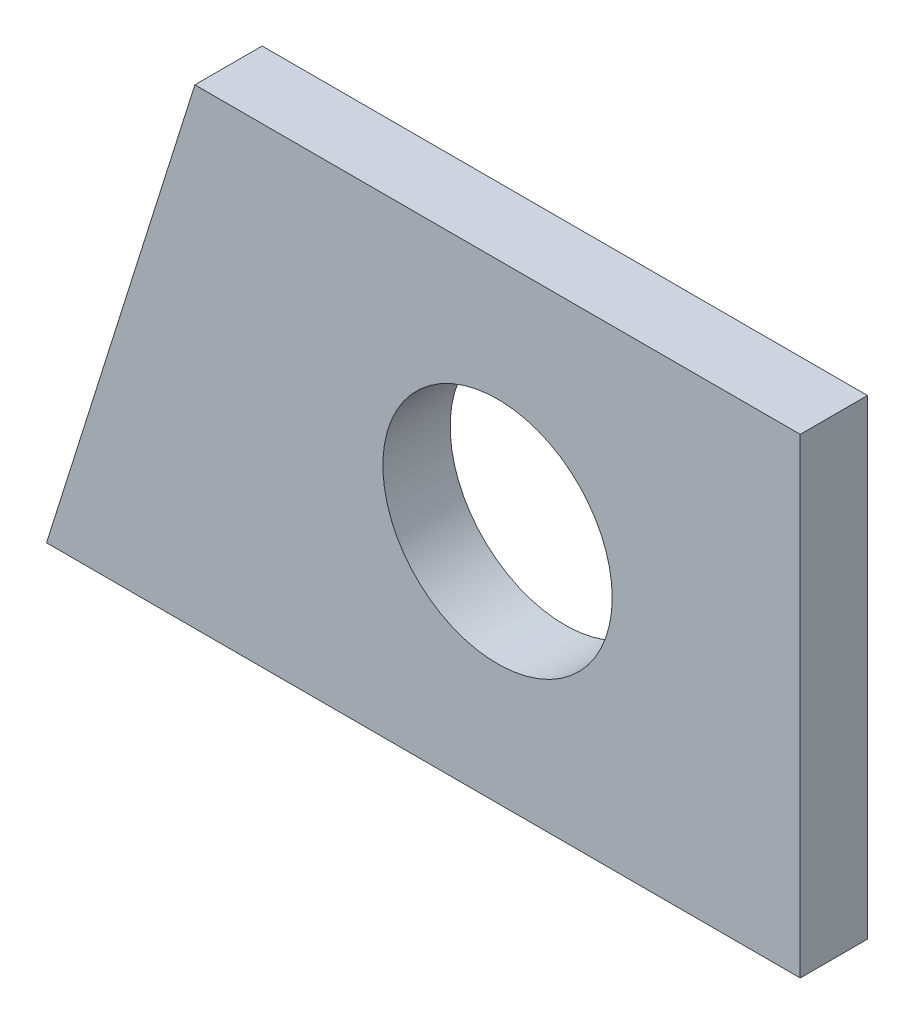
ISO-10303-21;
HEADER;
FILE_DESCRIPTION(('STEP AP214'),'2;1');
FILE_NAME('part.step','',(''),(''),'','','');
FILE_SCHEMA(('AUTOMOTIVE_DESIGN { 1 0 10303 214 1 1 1 1 }'));
ENDSEC;
DATA;
#1=APPLICATION_CONTEXT('core data for automotive mechanical design processes');
#2=APPLICATION_PROTOCOL_DEFINITION('international standard','automotive_design',2000,#1);
#3=PRODUCT_CONTEXT('',#1,'mechanical');
#4=PRODUCT('Part','Part','',(#3));
#5=PRODUCT_RELATED_PRODUCT_CATEGORY('part','',(#4));
#6=PRODUCT_DEFINITION_FORMATION('','',#4);
#7=PRODUCT_DEFINITION_CONTEXT('part definition',#1,'design');
#8=PRODUCT_DEFINITION('design','',#6,#7);
#9=PRODUCT_DEFINITION_SHAPE('','',#8);
#10=(LENGTH_UNIT() NAMED_UNIT(*) SI_UNIT(.MILLI.,.METRE.));
#11=(NAMED_UNIT(*) PLANE_ANGLE_UNIT() SI_UNIT($,.RADIAN.));
#12=(NAMED_UNIT(*) SI_UNIT($,.STERADIAN.) SOLID_ANGLE_UNIT());
#13=UNCERTAINTY_MEASURE_WITH_UNIT(LENGTH_MEASURE(1.E-05),#10,'distance_accuracy_value','');
#14=(GEOMETRIC_REPRESENTATION_CONTEXT(3) GLOBAL_UNCERTAINTY_ASSIGNED_CONTEXT((#13)) GLOBAL_UNIT_ASSIGNED_CONTEXT((#10,
#11,#12)) REPRESENTATION_CONTEXT('',''));
#15=CARTESIAN_POINT('',(0.,0.,0.));
#16=DIRECTION('',(0.,0.,1.));
#17=DIRECTION('',(1.,0.,0.));
#18=AXIS2_PLACEMENT_3D('',#15,#16,#17);
#19=CARTESIAN_POINT('',(0.,0.,1.));
#20=DIRECTION('',(0.,0.,-1.));
#21=DIRECTION('',(-1.,0.,0.));
#22=AXIS2_PLACEMENT_3D('',#19,#20,#21);
#23=PLANE('',#22);
#24=DIRECTION('',(-1.,0.,0.));
#25=VECTOR('',#24,1.);
#26=CARTESIAN_POINT('',(5.60287420464197,3.5,1.));
#27=LINE('',#26,#25);
#28=CARTESIAN_POINT('',(5.60287420464197,3.5,1.));
#29=VERTEX_POINT('',#28);
#30=CARTESIAN_POINT('',(-3.39712579535803,3.5,1.));
#31=VERTEX_POINT('',#30);
#32=EDGE_CURVE('E86',#29,#31,#27,.T.);
#33=ORIENTED_EDGE('',*,*,#32,.T.);
#34=DIRECTION('',(-0.300539339915884,-0.953769419284831,0.));
#35=VECTOR('',#34,1.);
#36=CARTESIAN_POINT('',(-3.39712579535803,3.5,1.));
#37=LINE('',#36,#35);
#38=CARTESIAN_POINT('',(-5.60287420464198,-3.5,1.));
#39=VERTEX_POINT('',#38);
#40=EDGE_CURVE('E81',#31,#39,#37,.T.);
#41=ORIENTED_EDGE('',*,*,#40,.T.);
#42=DIRECTION('',(1.,0.,0.));
#43=VECTOR('',#42,1.);
#44=CARTESIAN_POINT('',(-5.60287420464198,-3.5,1.));
#45=LINE('',#44,#43);
#46=CARTESIAN_POINT('',(5.60287420464197,-3.5,1.));
#47=VERTEX_POINT('',#46);
#48=EDGE_CURVE('E84',#39,#47,#45,.T.);
#49=ORIENTED_EDGE('',*,*,#48,.T.);
#50=DIRECTION('',(0.,1.,0.));
#51=VECTOR('',#50,1.);
#52=CARTESIAN_POINT('',(5.60287420464197,-3.5,1.));
#53=LINE('',#52,#51);
#54=EDGE_CURVE('E51',#47,#29,#53,.T.);
#55=ORIENTED_EDGE('',*,*,#54,.T.);
#56=EDGE_LOOP('',(#33,#41,#49,#55));
#57=FACE_BOUND('',#56,.T.);
#58=CARTESIAN_POINT('',(1.10287420464197,0.,1.));
#59=DIRECTION('',(0.,0.,1.));
#60=DIRECTION('',(1.,0.,0.));
#61=AXIS2_PLACEMENT_3D('',#58,#59,#60);
#62=CIRCLE('',#61,1.705);
#63=CARTESIAN_POINT('',(2.80787420464197,0.,1.));
#64=VERTEX_POINT('',#63);
#65=EDGE_CURVE('E101',#64,#64,#62,.T.);
#66=ORIENTED_EDGE('',*,*,#65,.F.);
#67=EDGE_LOOP('',(#66));
#68=FACE_BOUND('',#67,.T.);
#69=ADVANCED_FACE('F34',(#57,#68),#23,.F.);
#70=CARTESIAN_POINT('',(0.,0.,0.));
#71=DIRECTION('',(0.,0.,-1.));
#72=DIRECTION('',(-1.,0.,0.));
#73=AXIS2_PLACEMENT_3D('',#70,#71,#72);
#74=PLANE('',#73);
#75=DIRECTION('',(-1.,0.,0.));
#76=VECTOR('',#75,1.);
#77=CARTESIAN_POINT('',(5.60287420464197,3.5,0.));
#78=LINE('',#77,#76);
#79=CARTESIAN_POINT('',(5.60287420464197,3.5,0.));
#80=VERTEX_POINT('',#79);
#81=CARTESIAN_POINT('',(-3.39712579535803,3.5,0.));
#82=VERTEX_POINT('',#81);
#83=EDGE_CURVE('E98',#80,#82,#78,.T.);
#84=ORIENTED_EDGE('',*,*,#83,.F.);
#85=DIRECTION('',(0.,1.,0.));
#86=VECTOR('',#85,1.);
#87=CARTESIAN_POINT('',(5.60287420464197,-3.5,0.));
#88=LINE('',#87,#86);
#89=CARTESIAN_POINT('',(5.60287420464197,-3.5,0.));
#90=VERTEX_POINT('',#89);
#91=EDGE_CURVE('E74',#90,#80,#88,.T.);
#92=ORIENTED_EDGE('',*,*,#91,.F.);
#93=DIRECTION('',(1.,0.,0.));
#94=VECTOR('',#93,1.);
#95=CARTESIAN_POINT('',(-5.60287420464198,-3.5,0.));
#96=LINE('',#95,#94);
#97=CARTESIAN_POINT('',(-5.60287420464198,-3.5,0.));
#98=VERTEX_POINT('',#97);
#99=EDGE_CURVE('E68',#98,#90,#96,.T.);
#100=ORIENTED_EDGE('',*,*,#99,.F.);
#101=DIRECTION('',(-0.300539339915884,-0.953769419284831,0.));
#102=VECTOR('',#101,1.);
#103=CARTESIAN_POINT('',(-3.39712579535803,3.5,0.));
#104=LINE('',#103,#102);
#105=EDGE_CURVE('E90',#82,#98,#104,.T.);
#106=ORIENTED_EDGE('',*,*,#105,.F.);
#107=EDGE_LOOP('',(#84,#92,#100,#106));
#108=FACE_BOUND('',#107,.T.);
#109=CARTESIAN_POINT('',(1.10287420464197,0.,0.));
#110=DIRECTION('',(0.,0.,1.));
#111=DIRECTION('',(1.,0.,0.));
#112=AXIS2_PLACEMENT_3D('',#109,#110,#111);
#113=CIRCLE('',#112,1.705);
#114=CARTESIAN_POINT('',(2.80787420464197,0.,0.));
#115=VERTEX_POINT('',#114);
#116=EDGE_CURVE('E113',#115,#115,#113,.T.);
#117=ORIENTED_EDGE('',*,*,#116,.T.);
#118=EDGE_LOOP('',(#117));
#119=FACE_BOUND('',#118,.T.);
#120=ADVANCED_FACE('F109',(#108,#119),#74,.T.);
#121=CARTESIAN_POINT('',(5.60287420464197,3.5,1.));
#122=DIRECTION('',(0.,-1.,0.));
#123=DIRECTION('',(0.,0.,-1.));
#124=AXIS2_PLACEMENT_3D('',#121,#122,#123);
#125=PLANE('',#124);
#126=ORIENTED_EDGE('',*,*,#83,.T.);
#127=DIRECTION('',(0.,0.,-1.));
#128=VECTOR('',#127,1.);
#129=CARTESIAN_POINT('',(-3.39712579535803,3.5,1.));
#130=LINE('',#129,#128);
#131=EDGE_CURVE('E11',#31,#82,#130,.T.);
#132=ORIENTED_EDGE('',*,*,#131,.F.);
#133=ORIENTED_EDGE('',*,*,#32,.F.);
#134=DIRECTION('',(0.,0.,-1.));
#135=VECTOR('',#134,1.);
#136=CARTESIAN_POINT('',(5.60287420464197,3.5,1.));
#137=LINE('',#136,#135);
#138=EDGE_CURVE('E94',#29,#80,#137,.T.);
#139=ORIENTED_EDGE('',*,*,#138,.T.);
#140=EDGE_LOOP('',(#126,#132,#133,#139));
#141=FACE_BOUND('',#140,.T.);
#142=ADVANCED_FACE('F36',(#141),#125,.F.);
#143=CARTESIAN_POINT('',(-3.39712579535803,3.5,1.));
#144=DIRECTION('',(0.953769419284831,-0.300539339915884,0.));
#145=DIRECTION('',(0.300539339915884,0.953769419284831,0.));
#146=AXIS2_PLACEMENT_3D('',#143,#144,#145);
#147=PLANE('',#146);
#148=ORIENTED_EDGE('',*,*,#105,.T.);
#149=DIRECTION('',(0.,0.,-1.));
#150=VECTOR('',#149,1.);
#151=CARTESIAN_POINT('',(-5.60287420464198,-3.5,1.));
#152=LINE('',#151,#150);
#153=EDGE_CURVE('E43',#39,#98,#152,.T.);
#154=ORIENTED_EDGE('',*,*,#153,.F.);
#155=ORIENTED_EDGE('',*,*,#40,.F.);
#156=ORIENTED_EDGE('',*,*,#131,.T.);
#157=EDGE_LOOP('',(#148,#154,#155,#156));
#158=FACE_BOUND('',#157,.T.);
#159=ADVANCED_FACE('F89',(#158),#147,.F.);
#160=CARTESIAN_POINT('',(-5.60287420464198,-3.5,1.));
#161=DIRECTION('',(0.,1.,0.));
#162=DIRECTION('',(-1.,0.,0.));
#163=AXIS2_PLACEMENT_3D('',#160,#161,#162);
#164=PLANE('',#163);
#165=ORIENTED_EDGE('',*,*,#99,.T.);
#166=DIRECTION('',(0.,0.,-1.));
#167=VECTOR('',#166,1.);
#168=CARTESIAN_POINT('',(5.60287420464197,-3.5,1.));
#169=LINE('',#168,#167);
#170=EDGE_CURVE('E91',#47,#90,#169,.T.);
#171=ORIENTED_EDGE('',*,*,#170,.F.);
#172=ORIENTED_EDGE('',*,*,#48,.F.);
#173=ORIENTED_EDGE('',*,*,#153,.T.);
#174=EDGE_LOOP('',(#165,#171,#172,#173));
#175=FACE_BOUND('',#174,.T.);
#176=ADVANCED_FACE('F92',(#175),#164,.F.);
#177=CARTESIAN_POINT('',(5.60287420464197,-3.5,1.));
#178=DIRECTION('',(-1.,0.,0.));
#179=DIRECTION('',(0.,0.,1.));
#180=AXIS2_PLACEMENT_3D('',#177,#178,#179);
#181=PLANE('',#180);
#182=ORIENTED_EDGE('',*,*,#91,.T.);
#183=ORIENTED_EDGE('',*,*,#138,.F.);
#184=ORIENTED_EDGE('',*,*,#54,.F.);
#185=ORIENTED_EDGE('',*,*,#170,.T.);
#186=EDGE_LOOP('',(#182,#183,#184,#185));
#187=FACE_BOUND('',#186,.T.);
#188=ADVANCED_FACE('F106',(#187),#181,.F.);
#189=CARTESIAN_POINT('',(1.10287420464197,0.,1.));
#190=DIRECTION('',(0.,0.,-1.));
#191=DIRECTION('',(-1.,0.,0.));
#192=AXIS2_PLACEMENT_3D('',#189,#190,#191);
#193=CYLINDRICAL_SURFACE('',#192,1.705);
#194=ORIENTED_EDGE('',*,*,#65,.T.);
#195=EDGE_LOOP('',(#194));
#196=FACE_BOUND('',#195,.T.);
#197=ORIENTED_EDGE('',*,*,#116,.F.);
#198=EDGE_LOOP('',(#197));
#199=FACE_BOUND('',#198,.T.);
#200=ADVANCED_FACE('F119',(#196,#199),#193,.F.);
#201=CLOSED_SHELL('',(#69,#120,#142,#159,#176,#188,#200));
#202=MANIFOLD_SOLID_BREP('B2',#201);
#203=ADVANCED_BREP_SHAPE_REPRESENTATION('',(#18,#202),#14);
#204=SHAPE_DEFINITION_REPRESENTATION(#9,#203);
ENDSEC;
END-ISO-10303-21;
